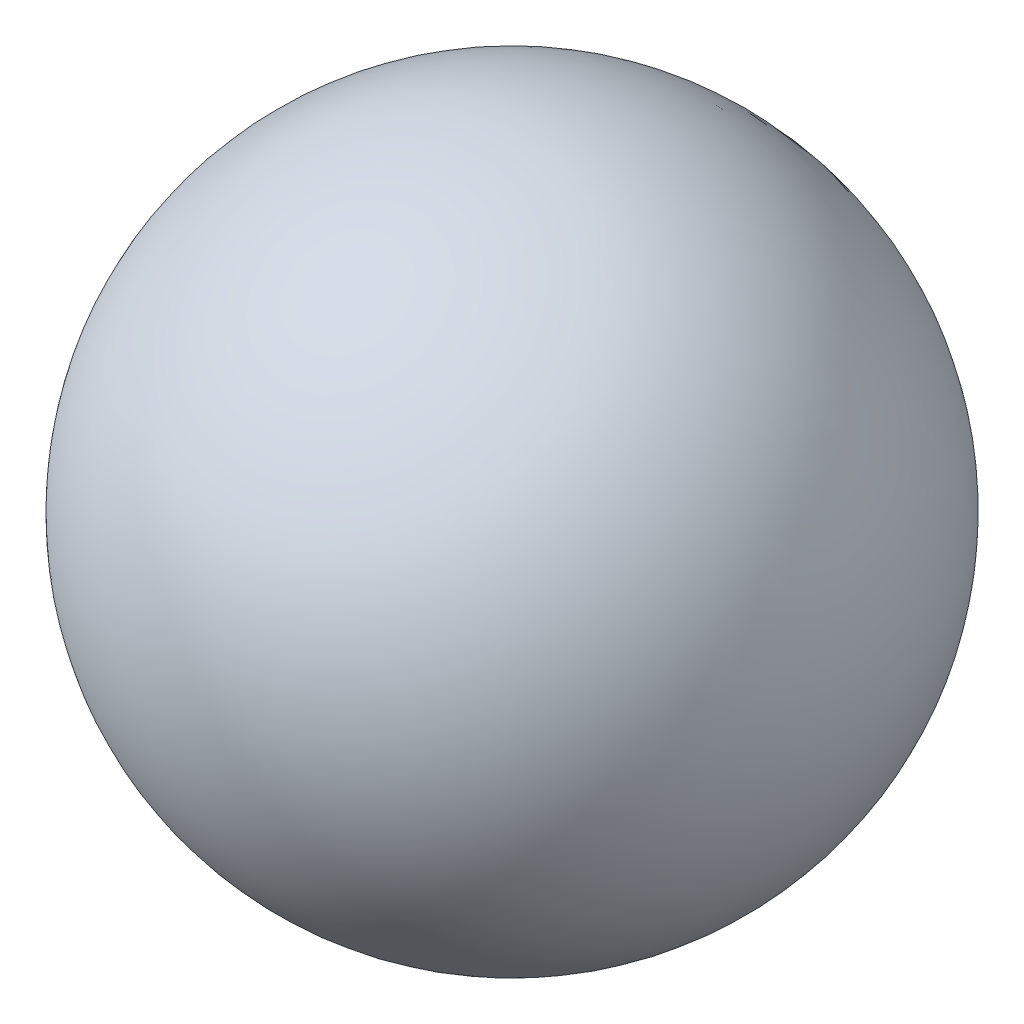
ISO-10303-21;
HEADER;
FILE_DESCRIPTION(('STEP AP214'),'2;1');
FILE_NAME('part.step','',(''),(''),'','','');
FILE_SCHEMA(('AUTOMOTIVE_DESIGN { 1 0 10303 214 1 1 1 1 }'));
ENDSEC;
DATA;
#1=APPLICATION_CONTEXT('core data for automotive mechanical design processes');
#2=APPLICATION_PROTOCOL_DEFINITION('international standard','automotive_design',2000,#1);
#3=PRODUCT_CONTEXT('',#1,'mechanical');
#4=PRODUCT('Part','Part','',(#3));
#5=PRODUCT_RELATED_PRODUCT_CATEGORY('part','',(#4));
#6=PRODUCT_DEFINITION_FORMATION('','',#4);
#7=PRODUCT_DEFINITION_CONTEXT('part definition',#1,'design');
#8=PRODUCT_DEFINITION('design','',#6,#7);
#9=PRODUCT_DEFINITION_SHAPE('','',#8);
#10=(LENGTH_UNIT() NAMED_UNIT(*) SI_UNIT(.MILLI.,.METRE.));
#11=(NAMED_UNIT(*) PLANE_ANGLE_UNIT() SI_UNIT($,.RADIAN.));
#12=(NAMED_UNIT(*) SI_UNIT($,.STERADIAN.) SOLID_ANGLE_UNIT());
#13=UNCERTAINTY_MEASURE_WITH_UNIT(LENGTH_MEASURE(1.E-05),#10,'distance_accuracy_value','');
#14=(GEOMETRIC_REPRESENTATION_CONTEXT(3) GLOBAL_UNCERTAINTY_ASSIGNED_CONTEXT((#13)) GLOBAL_UNIT_ASSIGNED_CONTEXT((#10,
#11,#12)) REPRESENTATION_CONTEXT('',''));
#15=CARTESIAN_POINT('',(0.,0.,0.));
#16=DIRECTION('',(0.,0.,1.));
#17=DIRECTION('',(1.,0.,0.));
#18=AXIS2_PLACEMENT_3D('',#15,#16,#17);
#19=CARTESIAN_POINT('',(64.16,-35.5315924589284,-59.5945184252094));
#20=DIRECTION('',(0.,-0.512108044606437,-0.85892103865802));
#21=DIRECTION('',(0.173648177666933,0.845872098095716,-0.504327972708341));
#22=AXIS2_PLACEMENT_3D('',#19,#20,#21);
#23=SPHERICAL_SURFACE('',#22,7.15);
#24=CARTESIAN_POINT('',(64.16,-31.8700199399924,-53.4532329988046));
#25=VERTEX_POINT('',#24);
#26=VERTEX_LOOP('',#25);
#27=FACE_BOUND('',#26,.T.);
#28=CARTESIAN_POINT('',(64.16,-39.1931649778644,-65.7358038516142));
#29=VERTEX_POINT('',#28);
#30=VERTEX_LOOP('',#29);
#31=FACE_BOUND('',#30,.T.);
#32=ADVANCED_FACE('F16',(#27,#31),#23,.T.);
#33=CLOSED_SHELL('',(#32));
#34=MANIFOLD_SOLID_BREP('B1',#33);
#35=ADVANCED_BREP_SHAPE_REPRESENTATION('',(#18,#34),#14);
#36=SHAPE_DEFINITION_REPRESENTATION(#9,#35);
ENDSEC;
END-ISO-10303-21;
